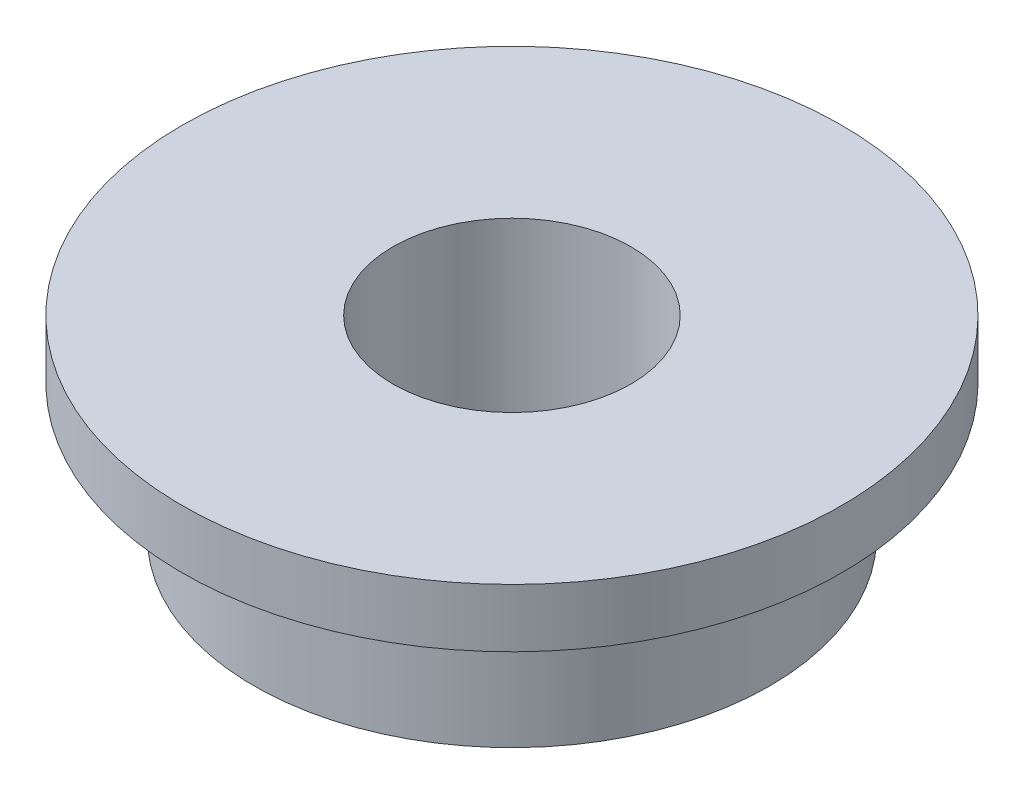
ISO-10303-21;
HEADER;
FILE_DESCRIPTION(('STEP AP214'),'2;1');
FILE_NAME('part.step','',(''),(''),'','','');
FILE_SCHEMA(('AUTOMOTIVE_DESIGN { 1 0 10303 214 1 1 1 1 }'));
ENDSEC;
DATA;
#1=APPLICATION_CONTEXT('core data for automotive mechanical design processes');
#2=APPLICATION_PROTOCOL_DEFINITION('international standard','automotive_design',2000,#1);
#3=PRODUCT_CONTEXT('',#1,'mechanical');
#4=PRODUCT('Part','Part','',(#3));
#5=PRODUCT_RELATED_PRODUCT_CATEGORY('part','',(#4));
#6=PRODUCT_DEFINITION_FORMATION('','',#4);
#7=PRODUCT_DEFINITION_CONTEXT('part definition',#1,'design');
#8=PRODUCT_DEFINITION('design','',#6,#7);
#9=PRODUCT_DEFINITION_SHAPE('','',#8);
#10=(LENGTH_UNIT() NAMED_UNIT(*) SI_UNIT(.MILLI.,.METRE.));
#11=(NAMED_UNIT(*) PLANE_ANGLE_UNIT() SI_UNIT($,.RADIAN.));
#12=(NAMED_UNIT(*) SI_UNIT($,.STERADIAN.) SOLID_ANGLE_UNIT());
#13=UNCERTAINTY_MEASURE_WITH_UNIT(LENGTH_MEASURE(1.E-05),#10,'distance_accuracy_value','');
#14=(GEOMETRIC_REPRESENTATION_CONTEXT(3) GLOBAL_UNCERTAINTY_ASSIGNED_CONTEXT((#13)) GLOBAL_UNIT_ASSIGNED_CONTEXT((#10,
#11,#12)) REPRESENTATION_CONTEXT('',''));
#15=CARTESIAN_POINT('',(0.,0.,0.));
#16=DIRECTION('',(0.,0.,1.));
#17=DIRECTION('',(1.,0.,0.));
#18=AXIS2_PLACEMENT_3D('',#15,#16,#17);
#19=CARTESIAN_POINT('',(-3.05206423963335,2.12862953696203,0.));
#20=DIRECTION('',(0.,1.,0.));
#21=DIRECTION('',(-1.,0.,0.));
#22=AXIS2_PLACEMENT_3D('',#19,#20,#21);
#23=CYLINDRICAL_SURFACE('',#22,13.8107882931578);
#24=CARTESIAN_POINT('',(-3.05206423963335,-1.45277046303797,0.));
#25=DIRECTION('',(0.,1.,0.));
#26=DIRECTION('',(-1.,0.,0.));
#27=AXIS2_PLACEMENT_3D('',#24,#25,#26);
#28=CIRCLE('',#27,13.8107882931578);
#29=CARTESIAN_POINT('',(-16.8628525327911,-1.45277046303797,0.));
#30=VERTEX_POINT('',#29);
#31=EDGE_CURVE('E34',#30,#30,#28,.F.);
#32=ORIENTED_EDGE('',*,*,#31,.F.);
#33=EDGE_LOOP('',(#32));
#34=FACE_BOUND('',#33,.T.);
#35=CARTESIAN_POINT('',(-3.05206423963335,5.71002953696203,0.));
#36=DIRECTION('',(0.,1.,0.));
#37=DIRECTION('',(-1.,0.,0.));
#38=AXIS2_PLACEMENT_3D('',#35,#36,#37);
#39=CIRCLE('',#38,13.8107882931578);
#40=CARTESIAN_POINT('',(-16.8628525327911,5.71002953696203,0.));
#41=VERTEX_POINT('',#40);
#42=EDGE_CURVE('E18',#41,#41,#39,.T.);
#43=ORIENTED_EDGE('',*,*,#42,.F.);
#44=EDGE_LOOP('',(#43));
#45=FACE_BOUND('',#44,.T.);
#46=ADVANCED_FACE('F15',(#34,#45),#23,.T.);
#47=CARTESIAN_POINT('',(-18.7839583862123,5.71002953696203,0.));
#48=DIRECTION('',(0.,-1.,0.));
#49=DIRECTION('',(0.,0.,-1.));
#50=AXIS2_PLACEMENT_3D('',#47,#48,#49);
#51=PLANE('',#50);
#52=ORIENTED_EDGE('',*,*,#42,.T.);
#53=EDGE_LOOP('',(#52));
#54=FACE_BOUND('',#53,.T.);
#55=CARTESIAN_POINT('',(-3.05206423963335,5.71002953696203,0.));
#56=DIRECTION('',(0.,1.,0.));
#57=DIRECTION('',(-1.,0.,0.));
#58=AXIS2_PLACEMENT_3D('',#55,#56,#57);
#59=CIRCLE('',#58,17.653);
#60=CARTESIAN_POINT('',(-20.7050642396334,5.71002953696203,0.));
#61=VERTEX_POINT('',#60);
#62=EDGE_CURVE('E32',#61,#61,#59,.T.);
#63=ORIENTED_EDGE('',*,*,#62,.F.);
#64=EDGE_LOOP('',(#63));
#65=FACE_BOUND('',#64,.T.);
#66=ADVANCED_FACE('F41',(#54,#65),#51,.T.);
#67=CARTESIAN_POINT('',(-9.95745838621226,-1.45277046303797,0.));
#68=DIRECTION('',(0.,-1.,0.));
#69=DIRECTION('',(0.,0.,-1.));
#70=AXIS2_PLACEMENT_3D('',#67,#68,#69);
#71=PLANE('',#70);
#72=CARTESIAN_POINT('',(-3.05206423963336,-1.45277046303798,0.));
#73=DIRECTION('',(0.,1.,0.));
#74=DIRECTION('',(-1.,0.,0.));
#75=AXIS2_PLACEMENT_3D('',#72,#73,#74);
#76=CIRCLE('',#75,6.3754);
#77=CARTESIAN_POINT('',(-9.42746423963337,-1.45277046303798,0.));
#78=VERTEX_POINT('',#77);
#79=EDGE_CURVE('E27',#78,#78,#76,.T.);
#80=ORIENTED_EDGE('',*,*,#79,.T.);
#81=EDGE_LOOP('',(#80));
#82=FACE_BOUND('',#81,.T.);
#83=ORIENTED_EDGE('',*,*,#31,.T.);
#84=EDGE_LOOP('',(#83));
#85=FACE_BOUND('',#84,.T.);
#86=ADVANCED_FACE('F50',(#82,#85),#71,.T.);
#87=CARTESIAN_POINT('',(-3.05206423963335,7.27212953696203,0.));
#88=DIRECTION('',(0.,1.,0.));
#89=DIRECTION('',(-1.,0.,0.));
#90=AXIS2_PLACEMENT_3D('',#87,#88,#89);
#91=CYLINDRICAL_SURFACE('',#90,17.653);
#92=ORIENTED_EDGE('',*,*,#62,.T.);
#93=EDGE_LOOP('',(#92));
#94=FACE_BOUND('',#93,.T.);
#95=CARTESIAN_POINT('',(-3.05206423963335,8.83422953696203,0.));
#96=DIRECTION('',(0.,1.,0.));
#97=DIRECTION('',(-1.,0.,0.));
#98=AXIS2_PLACEMENT_3D('',#95,#96,#97);
#99=CIRCLE('',#98,17.653);
#100=CARTESIAN_POINT('',(-20.7050642396334,8.83422953696203,0.));
#101=VERTEX_POINT('',#100);
#102=EDGE_CURVE('E22',#101,#101,#99,.T.);
#103=ORIENTED_EDGE('',*,*,#102,.F.);
#104=EDGE_LOOP('',(#103));
#105=FACE_BOUND('',#104,.T.);
#106=ADVANCED_FACE('F58',(#94,#105),#91,.T.);
#107=CARTESIAN_POINT('',(-3.05206423963335,-42.1446841529161,0.));
#108=DIRECTION('',(0.,1.,0.));
#109=DIRECTION('',(-1.,0.,0.));
#110=AXIS2_PLACEMENT_3D('',#107,#108,#109);
#111=CYLINDRICAL_SURFACE('',#110,6.3754);
#112=CARTESIAN_POINT('',(-3.05206423963337,8.83422953696203,0.));
#113=DIRECTION('',(0.,1.,0.));
#114=DIRECTION('',(-1.,0.,0.));
#115=AXIS2_PLACEMENT_3D('',#112,#113,#114);
#116=CIRCLE('',#115,6.3754);
#117=CARTESIAN_POINT('',(-9.42746423963337,8.83422953696203,0.));
#118=VERTEX_POINT('',#117);
#119=EDGE_CURVE('E10',#118,#118,#116,.F.);
#120=ORIENTED_EDGE('',*,*,#119,.F.);
#121=EDGE_LOOP('',(#120));
#122=FACE_BOUND('',#121,.T.);
#123=ORIENTED_EDGE('',*,*,#79,.F.);
#124=EDGE_LOOP('',(#123));
#125=FACE_BOUND('',#124,.T.);
#126=ADVANCED_FACE('F53',(#122,#125),#111,.F.);
#127=CARTESIAN_POINT('',(-11.8785642396334,8.83422953696203,0.));
#128=DIRECTION('',(0.,1.,0.));
#129=DIRECTION('',(0.,0.,1.));
#130=AXIS2_PLACEMENT_3D('',#127,#128,#129);
#131=PLANE('',#130);
#132=ORIENTED_EDGE('',*,*,#119,.T.);
#133=EDGE_LOOP('',(#132));
#134=FACE_BOUND('',#133,.T.);
#135=ORIENTED_EDGE('',*,*,#102,.T.);
#136=EDGE_LOOP('',(#135));
#137=FACE_BOUND('',#136,.T.);
#138=ADVANCED_FACE('F51',(#134,#137),#131,.T.);
#139=CLOSED_SHELL('',(#46,#66,#86,#106,#126,#138));
#140=MANIFOLD_SOLID_BREP('B1',#139);
#141=ADVANCED_BREP_SHAPE_REPRESENTATION('',(#18,#140),#14);
#142=SHAPE_DEFINITION_REPRESENTATION(#9,#141);
ENDSEC;
END-ISO-10303-21;
